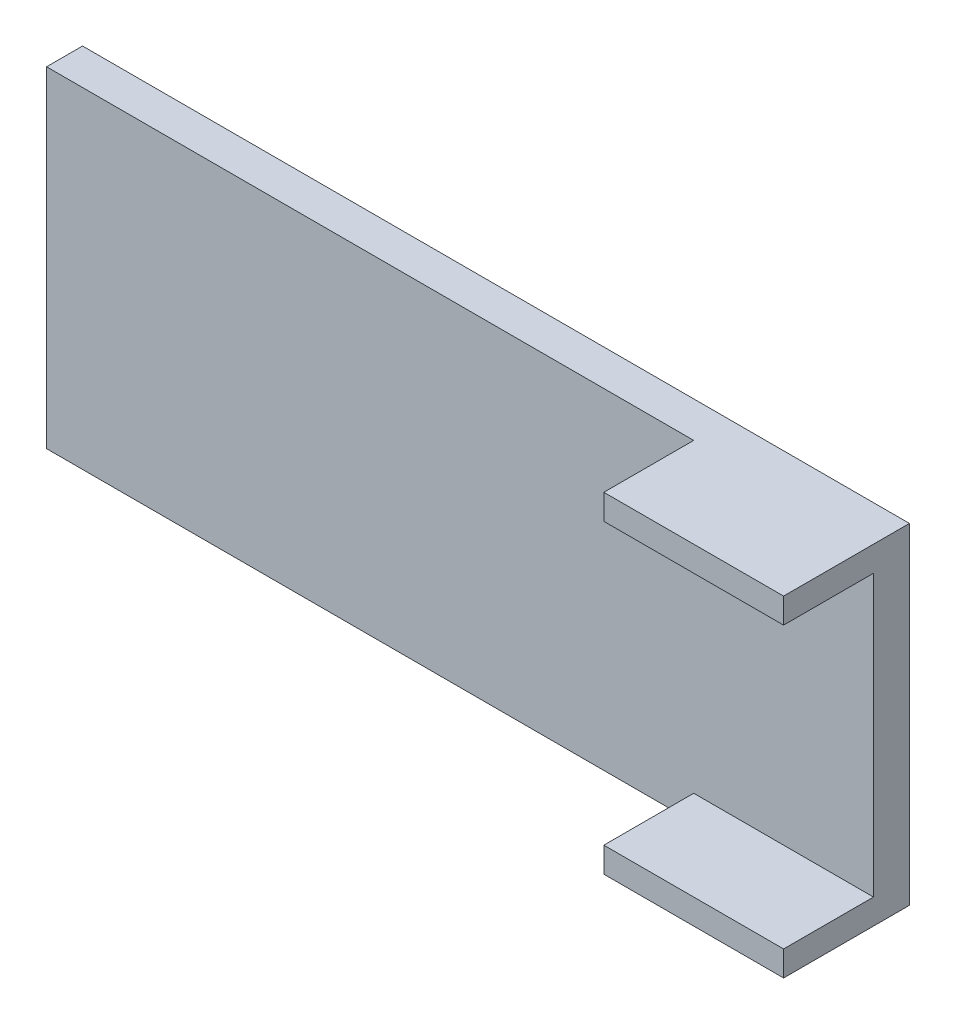
ISO-10303-21;
HEADER;
FILE_DESCRIPTION(('STEP AP214'),'2;1');
FILE_NAME('part.step','',(''),(''),'','','');
FILE_SCHEMA(('AUTOMOTIVE_DESIGN { 1 0 10303 214 1 1 1 1 }'));
ENDSEC;
DATA;
#1=APPLICATION_CONTEXT('core data for automotive mechanical design processes');
#2=APPLICATION_PROTOCOL_DEFINITION('international standard','automotive_design',2000,#1);
#3=PRODUCT_CONTEXT('',#1,'mechanical');
#4=PRODUCT('Part','Part','',(#3));
#5=PRODUCT_RELATED_PRODUCT_CATEGORY('part','',(#4));
#6=PRODUCT_DEFINITION_FORMATION('','',#4);
#7=PRODUCT_DEFINITION_CONTEXT('part definition',#1,'design');
#8=PRODUCT_DEFINITION('design','',#6,#7);
#9=PRODUCT_DEFINITION_SHAPE('','',#8);
#10=(LENGTH_UNIT() NAMED_UNIT(*) SI_UNIT(.MILLI.,.METRE.));
#11=(NAMED_UNIT(*) PLANE_ANGLE_UNIT() SI_UNIT($,.RADIAN.));
#12=(NAMED_UNIT(*) SI_UNIT($,.STERADIAN.) SOLID_ANGLE_UNIT());
#13=UNCERTAINTY_MEASURE_WITH_UNIT(LENGTH_MEASURE(1.E-05),#10,'distance_accuracy_value','');
#14=(GEOMETRIC_REPRESENTATION_CONTEXT(3) GLOBAL_UNCERTAINTY_ASSIGNED_CONTEXT((#13)) GLOBAL_UNIT_ASSIGNED_CONTEXT((#10,
#11,#12)) REPRESENTATION_CONTEXT('',''));
#15=CARTESIAN_POINT('',(0.,0.,0.));
#16=DIRECTION('',(0.,0.,1.));
#17=DIRECTION('',(1.,0.,0.));
#18=AXIS2_PLACEMENT_3D('',#15,#16,#17);
#19=CARTESIAN_POINT('',(0.,0.,2.54));
#20=DIRECTION('',(0.,0.,-1.));
#21=DIRECTION('',(-1.,0.,0.));
#22=AXIS2_PLACEMENT_3D('',#19,#20,#21);
#23=PLANE('',#22);
#24=DIRECTION('',(-1.,0.,0.));
#25=VECTOR('',#24,1.);
#26=CARTESIAN_POINT('',(29.21,-9.90599999999999,2.54));
#27=LINE('',#26,#25);
#28=CARTESIAN_POINT('',(29.21,-9.90599999999999,2.54));
#29=VERTEX_POINT('',#28);
#30=CARTESIAN_POINT('',(16.51,-9.90599999999999,2.54));
#31=VERTEX_POINT('',#30);
#32=EDGE_CURVE('E53',#29,#31,#27,.T.);
#33=ORIENTED_EDGE('',*,*,#32,.F.);
#34=DIRECTION('',(0.,1.,0.));
#35=VECTOR('',#34,1.);
#36=CARTESIAN_POINT('',(29.21,-11.684,2.54));
#37=LINE('',#36,#35);
#38=CARTESIAN_POINT('',(29.21,9.90600000000001,2.54));
#39=VERTEX_POINT('',#38);
#40=EDGE_CURVE('E131',#29,#39,#37,.T.);
#41=ORIENTED_EDGE('',*,*,#40,.T.);
#42=DIRECTION('',(1.,0.,0.));
#43=VECTOR('',#42,1.);
#44=CARTESIAN_POINT('',(29.21,9.90600000000001,2.54));
#45=LINE('',#44,#43);
#46=CARTESIAN_POINT('',(16.51,9.90600000000001,2.54));
#47=VERTEX_POINT('',#46);
#48=EDGE_CURVE('E135',#47,#39,#45,.T.);
#49=ORIENTED_EDGE('',*,*,#48,.F.);
#50=DIRECTION('',(0.,-1.,0.));
#51=VECTOR('',#50,1.);
#52=CARTESIAN_POINT('',(16.51,11.684,2.54));
#53=LINE('',#52,#51);
#54=CARTESIAN_POINT('',(16.51,11.684,2.54));
#55=VERTEX_POINT('',#54);
#56=EDGE_CURVE('E132',#55,#47,#53,.T.);
#57=ORIENTED_EDGE('',*,*,#56,.F.);
#58=DIRECTION('',(-1.,0.,0.));
#59=VECTOR('',#58,1.);
#60=CARTESIAN_POINT('',(-29.21,11.684,2.54));
#61=LINE('',#60,#59);
#62=CARTESIAN_POINT('',(-29.21,11.684,2.54));
#63=VERTEX_POINT('',#62);
#64=EDGE_CURVE('E162',#55,#63,#61,.T.);
#65=ORIENTED_EDGE('',*,*,#64,.T.);
#66=DIRECTION('',(0.,-1.,0.));
#67=VECTOR('',#66,1.);
#68=CARTESIAN_POINT('',(-29.21,-11.684,2.54));
#69=LINE('',#68,#67);
#70=CARTESIAN_POINT('',(-29.21,-11.684,2.54));
#71=VERTEX_POINT('',#70);
#72=EDGE_CURVE('E165',#63,#71,#69,.T.);
#73=ORIENTED_EDGE('',*,*,#72,.T.);
#74=DIRECTION('',(1.,0.,0.));
#75=VECTOR('',#74,1.);
#76=CARTESIAN_POINT('',(-29.21,-11.684,2.54));
#77=LINE('',#76,#75);
#78=CARTESIAN_POINT('',(16.51,-11.684,2.54));
#79=VERTEX_POINT('',#78);
#80=EDGE_CURVE('E167',#71,#79,#77,.T.);
#81=ORIENTED_EDGE('',*,*,#80,.T.);
#82=DIRECTION('',(0.,-1.,0.));
#83=VECTOR('',#82,1.);
#84=CARTESIAN_POINT('',(16.51,-11.684,2.54));
#85=LINE('',#84,#83);
#86=EDGE_CURVE('E49',#31,#79,#85,.T.);
#87=ORIENTED_EDGE('',*,*,#86,.F.);
#88=EDGE_LOOP('',(#33,#41,#49,#57,#65,#73,#81,#87));
#89=FACE_BOUND('',#88,.T.);
#90=ADVANCED_FACE('F34',(#89),#23,.F.);
#91=CARTESIAN_POINT('',(29.21,-11.684,2.54));
#92=DIRECTION('',(-1.,0.,0.));
#93=DIRECTION('',(0.,0.,1.));
#94=AXIS2_PLACEMENT_3D('',#91,#92,#93);
#95=PLANE('',#94);
#96=DIRECTION('',(0.,1.,0.));
#97=VECTOR('',#96,1.);
#98=CARTESIAN_POINT('',(29.21,-11.684,0.));
#99=LINE('',#98,#97);
#100=CARTESIAN_POINT('',(29.21,-11.684,0.));
#101=VERTEX_POINT('',#100);
#102=CARTESIAN_POINT('',(29.21,11.684,0.));
#103=VERTEX_POINT('',#102);
#104=EDGE_CURVE('E160',#101,#103,#99,.T.);
#105=ORIENTED_EDGE('',*,*,#104,.T.);
#106=DIRECTION('',(0.,0.,-1.));
#107=VECTOR('',#106,1.);
#108=CARTESIAN_POINT('',(29.21,11.684,2.54));
#109=LINE('',#108,#107);
#110=CARTESIAN_POINT('',(29.21,11.684,8.89));
#111=VERTEX_POINT('',#110);
#112=EDGE_CURVE('E11',#111,#103,#109,.T.);
#113=ORIENTED_EDGE('',*,*,#112,.F.);
#114=DIRECTION('',(0.,1.,0.));
#115=VECTOR('',#114,1.);
#116=CARTESIAN_POINT('',(29.21,11.684,8.89));
#117=LINE('',#116,#115);
#118=CARTESIAN_POINT('',(29.21,9.90600000000001,8.89));
#119=VERTEX_POINT('',#118);
#120=EDGE_CURVE('E141',#119,#111,#117,.T.);
#121=ORIENTED_EDGE('',*,*,#120,.F.);
#122=DIRECTION('',(0.,0.,-1.));
#123=VECTOR('',#122,1.);
#124=CARTESIAN_POINT('',(29.21,9.90600000000001,8.89));
#125=LINE('',#124,#123);
#126=EDGE_CURVE('E149',#119,#39,#125,.T.);
#127=ORIENTED_EDGE('',*,*,#126,.T.);
#128=ORIENTED_EDGE('',*,*,#40,.F.);
#129=DIRECTION('',(0.,0.,-1.));
#130=VECTOR('',#129,1.);
#131=CARTESIAN_POINT('',(29.21,-9.90599999999999,8.89));
#132=LINE('',#131,#130);
#133=CARTESIAN_POINT('',(29.21,-9.90599999999999,8.89));
#134=VERTEX_POINT('',#133);
#135=EDGE_CURVE('E113',#134,#29,#132,.T.);
#136=ORIENTED_EDGE('',*,*,#135,.F.);
#137=DIRECTION('',(0.,1.,0.));
#138=VECTOR('',#137,1.);
#139=CARTESIAN_POINT('',(29.21,-11.684,8.89));
#140=LINE('',#139,#138);
#141=CARTESIAN_POINT('',(29.21,-11.684,8.89));
#142=VERTEX_POINT('',#141);
#143=EDGE_CURVE('E119',#142,#134,#140,.T.);
#144=ORIENTED_EDGE('',*,*,#143,.F.);
#145=DIRECTION('',(0.,0.,-1.));
#146=VECTOR('',#145,1.);
#147=CARTESIAN_POINT('',(29.21,-11.684,2.54));
#148=LINE('',#147,#146);
#149=EDGE_CURVE('E169',#142,#101,#148,.T.);
#150=ORIENTED_EDGE('',*,*,#149,.T.);
#151=EDGE_LOOP('',(#105,#113,#121,#127,#128,#136,#144,#150));
#152=FACE_BOUND('',#151,.T.);
#153=ADVANCED_FACE('F36',(#152),#95,.F.);
#154=CARTESIAN_POINT('',(-29.21,11.684,2.54));
#155=DIRECTION('',(0.,-1.,0.));
#156=DIRECTION('',(0.,0.,-1.));
#157=AXIS2_PLACEMENT_3D('',#154,#155,#156);
#158=PLANE('',#157);
#159=DIRECTION('',(-1.,0.,0.));
#160=VECTOR('',#159,1.);
#161=CARTESIAN_POINT('',(-29.21,11.684,0.));
#162=LINE('',#161,#160);
#163=CARTESIAN_POINT('',(-29.21,11.684,0.));
#164=VERTEX_POINT('',#163);
#165=EDGE_CURVE('E171',#103,#164,#162,.T.);
#166=ORIENTED_EDGE('',*,*,#165,.T.);
#167=DIRECTION('',(0.,0.,-1.));
#168=VECTOR('',#167,1.);
#169=CARTESIAN_POINT('',(-29.21,11.684,2.54));
#170=LINE('',#169,#168);
#171=EDGE_CURVE('E42',#63,#164,#170,.T.);
#172=ORIENTED_EDGE('',*,*,#171,.F.);
#173=ORIENTED_EDGE('',*,*,#64,.F.);
#174=DIRECTION('',(0.,0.,-1.));
#175=VECTOR('',#174,1.);
#176=CARTESIAN_POINT('',(16.51,11.684,8.89));
#177=LINE('',#176,#175);
#178=CARTESIAN_POINT('',(16.51,11.684,8.89));
#179=VERTEX_POINT('',#178);
#180=EDGE_CURVE('E157',#179,#55,#177,.T.);
#181=ORIENTED_EDGE('',*,*,#180,.F.);
#182=DIRECTION('',(-1.,0.,0.));
#183=VECTOR('',#182,1.);
#184=CARTESIAN_POINT('',(29.21,11.684,8.89));
#185=LINE('',#184,#183);
#186=EDGE_CURVE('E144',#111,#179,#185,.T.);
#187=ORIENTED_EDGE('',*,*,#186,.F.);
#188=ORIENTED_EDGE('',*,*,#112,.T.);
#189=EDGE_LOOP('',(#166,#172,#173,#181,#187,#188));
#190=FACE_BOUND('',#189,.T.);
#191=ADVANCED_FACE('F198',(#190),#158,.F.);
#192=CARTESIAN_POINT('',(-29.21,-11.684,2.54));
#193=DIRECTION('',(1.,0.,0.));
#194=DIRECTION('',(0.,0.,-1.));
#195=AXIS2_PLACEMENT_3D('',#192,#193,#194);
#196=PLANE('',#195);
#197=DIRECTION('',(0.,-1.,0.));
#198=VECTOR('',#197,1.);
#199=CARTESIAN_POINT('',(-29.21,-11.684,0.));
#200=LINE('',#199,#198);
#201=CARTESIAN_POINT('',(-29.21,-11.684,0.));
#202=VERTEX_POINT('',#201);
#203=EDGE_CURVE('E173',#164,#202,#200,.T.);
#204=ORIENTED_EDGE('',*,*,#203,.T.);
#205=DIRECTION('',(0.,0.,-1.));
#206=VECTOR('',#205,1.);
#207=CARTESIAN_POINT('',(-29.21,-11.684,2.54));
#208=LINE('',#207,#206);
#209=EDGE_CURVE('E177',#71,#202,#208,.T.);
#210=ORIENTED_EDGE('',*,*,#209,.F.);
#211=ORIENTED_EDGE('',*,*,#72,.F.);
#212=ORIENTED_EDGE('',*,*,#171,.T.);
#213=EDGE_LOOP('',(#204,#210,#211,#212));
#214=FACE_BOUND('',#213,.T.);
#215=ADVANCED_FACE('F184',(#214),#196,.F.);
#216=CARTESIAN_POINT('',(-29.21,-11.684,2.54));
#217=DIRECTION('',(0.,1.,0.));
#218=DIRECTION('',(0.,0.,1.));
#219=AXIS2_PLACEMENT_3D('',#216,#217,#218);
#220=PLANE('',#219);
#221=DIRECTION('',(1.,0.,0.));
#222=VECTOR('',#221,1.);
#223=CARTESIAN_POINT('',(-29.21,-11.684,0.));
#224=LINE('',#223,#222);
#225=EDGE_CURVE('E163',#202,#101,#224,.T.);
#226=ORIENTED_EDGE('',*,*,#225,.T.);
#227=ORIENTED_EDGE('',*,*,#149,.F.);
#228=DIRECTION('',(1.,0.,0.));
#229=VECTOR('',#228,1.);
#230=CARTESIAN_POINT('',(29.21,-11.684,8.89));
#231=LINE('',#230,#229);
#232=CARTESIAN_POINT('',(16.51,-11.684,8.89));
#233=VERTEX_POINT('',#232);
#234=EDGE_CURVE('E125',#233,#142,#231,.T.);
#235=ORIENTED_EDGE('',*,*,#234,.F.);
#236=DIRECTION('',(0.,0.,-1.));
#237=VECTOR('',#236,1.);
#238=CARTESIAN_POINT('',(16.51,-11.684,8.89));
#239=LINE('',#238,#237);
#240=EDGE_CURVE('E137',#233,#79,#239,.T.);
#241=ORIENTED_EDGE('',*,*,#240,.T.);
#242=ORIENTED_EDGE('',*,*,#80,.F.);
#243=ORIENTED_EDGE('',*,*,#209,.T.);
#244=EDGE_LOOP('',(#226,#227,#235,#241,#242,#243));
#245=FACE_BOUND('',#244,.T.);
#246=ADVANCED_FACE('F193',(#245),#220,.F.);
#247=CARTESIAN_POINT('',(0.,0.,0.));
#248=DIRECTION('',(0.,0.,-1.));
#249=DIRECTION('',(-1.,0.,0.));
#250=AXIS2_PLACEMENT_3D('',#247,#248,#249);
#251=PLANE('',#250);
#252=ORIENTED_EDGE('',*,*,#104,.F.);
#253=ORIENTED_EDGE('',*,*,#225,.F.);
#254=ORIENTED_EDGE('',*,*,#203,.F.);
#255=ORIENTED_EDGE('',*,*,#165,.F.);
#256=EDGE_LOOP('',(#252,#253,#254,#255));
#257=FACE_BOUND('',#256,.T.);
#258=ADVANCED_FACE('F191',(#257),#251,.T.);
#259=CARTESIAN_POINT('',(16.51,11.684,8.89));
#260=DIRECTION('',(1.,0.,0.));
#261=DIRECTION('',(0.,0.,-1.));
#262=AXIS2_PLACEMENT_3D('',#259,#260,#261);
#263=PLANE('',#262);
#264=ORIENTED_EDGE('',*,*,#56,.T.);
#265=DIRECTION('',(0.,0.,-1.));
#266=VECTOR('',#265,1.);
#267=CARTESIAN_POINT('',(16.51,9.90600000000001,8.89));
#268=LINE('',#267,#266);
#269=CARTESIAN_POINT('',(16.51,9.90600000000001,8.89));
#270=VERTEX_POINT('',#269);
#271=EDGE_CURVE('E154',#270,#47,#268,.T.);
#272=ORIENTED_EDGE('',*,*,#271,.F.);
#273=DIRECTION('',(0.,-1.,0.));
#274=VECTOR('',#273,1.);
#275=CARTESIAN_POINT('',(16.51,11.684,8.89));
#276=LINE('',#275,#274);
#277=EDGE_CURVE('E146',#179,#270,#276,.T.);
#278=ORIENTED_EDGE('',*,*,#277,.F.);
#279=ORIENTED_EDGE('',*,*,#180,.T.);
#280=EDGE_LOOP('',(#264,#272,#278,#279));
#281=FACE_BOUND('',#280,.T.);
#282=ADVANCED_FACE('F208',(#281),#263,.F.);
#283=CARTESIAN_POINT('',(29.21,9.90600000000001,8.89));
#284=DIRECTION('',(0.,1.,0.));
#285=DIRECTION('',(-1.,0.,0.));
#286=AXIS2_PLACEMENT_3D('',#283,#284,#285);
#287=PLANE('',#286);
#288=ORIENTED_EDGE('',*,*,#48,.T.);
#289=ORIENTED_EDGE('',*,*,#126,.F.);
#290=DIRECTION('',(1.,0.,0.));
#291=VECTOR('',#290,1.);
#292=CARTESIAN_POINT('',(29.21,9.90600000000001,8.89));
#293=LINE('',#292,#291);
#294=EDGE_CURVE('E148',#270,#119,#293,.T.);
#295=ORIENTED_EDGE('',*,*,#294,.F.);
#296=ORIENTED_EDGE('',*,*,#271,.T.);
#297=EDGE_LOOP('',(#288,#289,#295,#296));
#298=FACE_BOUND('',#297,.T.);
#299=ADVANCED_FACE('F206',(#298),#287,.F.);
#300=CARTESIAN_POINT('',(0.,0.,8.89));
#301=DIRECTION('',(0.,0.,-1.));
#302=DIRECTION('',(-1.,0.,0.));
#303=AXIS2_PLACEMENT_3D('',#300,#301,#302);
#304=PLANE('',#303);
#305=ORIENTED_EDGE('',*,*,#120,.T.);
#306=ORIENTED_EDGE('',*,*,#186,.T.);
#307=ORIENTED_EDGE('',*,*,#277,.T.);
#308=ORIENTED_EDGE('',*,*,#294,.T.);
#309=EDGE_LOOP('',(#305,#306,#307,#308));
#310=FACE_BOUND('',#309,.T.);
#311=ADVANCED_FACE('F201',(#310),#304,.F.);
#312=CARTESIAN_POINT('',(29.21,-9.90599999999999,8.89));
#313=DIRECTION('',(0.,-1.,0.));
#314=DIRECTION('',(1.,0.,0.));
#315=AXIS2_PLACEMENT_3D('',#312,#313,#314);
#316=PLANE('',#315);
#317=ORIENTED_EDGE('',*,*,#32,.T.);
#318=DIRECTION('',(0.,0.,-1.));
#319=VECTOR('',#318,1.);
#320=CARTESIAN_POINT('',(16.51,-9.90599999999999,8.89));
#321=LINE('',#320,#319);
#322=CARTESIAN_POINT('',(16.51,-9.90599999999999,8.89));
#323=VERTEX_POINT('',#322);
#324=EDGE_CURVE('E115',#323,#31,#321,.T.);
#325=ORIENTED_EDGE('',*,*,#324,.F.);
#326=DIRECTION('',(-1.,0.,0.));
#327=VECTOR('',#326,1.);
#328=CARTESIAN_POINT('',(29.21,-9.90599999999999,8.89));
#329=LINE('',#328,#327);
#330=EDGE_CURVE('E109',#134,#323,#329,.T.);
#331=ORIENTED_EDGE('',*,*,#330,.F.);
#332=ORIENTED_EDGE('',*,*,#135,.T.);
#333=EDGE_LOOP('',(#317,#325,#331,#332));
#334=FACE_BOUND('',#333,.T.);
#335=ADVANCED_FACE('F111',(#334),#316,.F.);
#336=CARTESIAN_POINT('',(16.51,-11.684,8.89));
#337=DIRECTION('',(1.,0.,0.));
#338=DIRECTION('',(0.,0.,-1.));
#339=AXIS2_PLACEMENT_3D('',#336,#337,#338);
#340=PLANE('',#339);
#341=ORIENTED_EDGE('',*,*,#86,.T.);
#342=ORIENTED_EDGE('',*,*,#240,.F.);
#343=DIRECTION('',(0.,-1.,0.));
#344=VECTOR('',#343,1.);
#345=CARTESIAN_POINT('',(16.51,-11.684,8.89));
#346=LINE('',#345,#344);
#347=EDGE_CURVE('E118',#323,#233,#346,.T.);
#348=ORIENTED_EDGE('',*,*,#347,.F.);
#349=ORIENTED_EDGE('',*,*,#324,.T.);
#350=EDGE_LOOP('',(#341,#342,#348,#349));
#351=FACE_BOUND('',#350,.T.);
#352=ADVANCED_FACE('F291',(#351),#340,.F.);
#353=CARTESIAN_POINT('',(0.,0.,8.89));
#354=DIRECTION('',(0.,0.,1.));
#355=DIRECTION('',(1.,0.,0.));
#356=AXIS2_PLACEMENT_3D('',#353,#354,#355);
#357=PLANE('',#356);
#358=ORIENTED_EDGE('',*,*,#143,.T.);
#359=ORIENTED_EDGE('',*,*,#330,.T.);
#360=ORIENTED_EDGE('',*,*,#347,.T.);
#361=ORIENTED_EDGE('',*,*,#234,.T.);
#362=EDGE_LOOP('',(#358,#359,#360,#361));
#363=FACE_BOUND('',#362,.T.);
#364=ADVANCED_FACE('F123',(#363),#357,.T.);
#365=CLOSED_SHELL('',(#90,#153,#191,#215,#246,#258,#282,#299,#311,#335,#352,#364));
#366=MANIFOLD_SOLID_BREP('B2',#365);
#367=ADVANCED_BREP_SHAPE_REPRESENTATION('',(#18,#366),#14);
#368=SHAPE_DEFINITION_REPRESENTATION(#9,#367);
ENDSEC;
END-ISO-10303-21;
